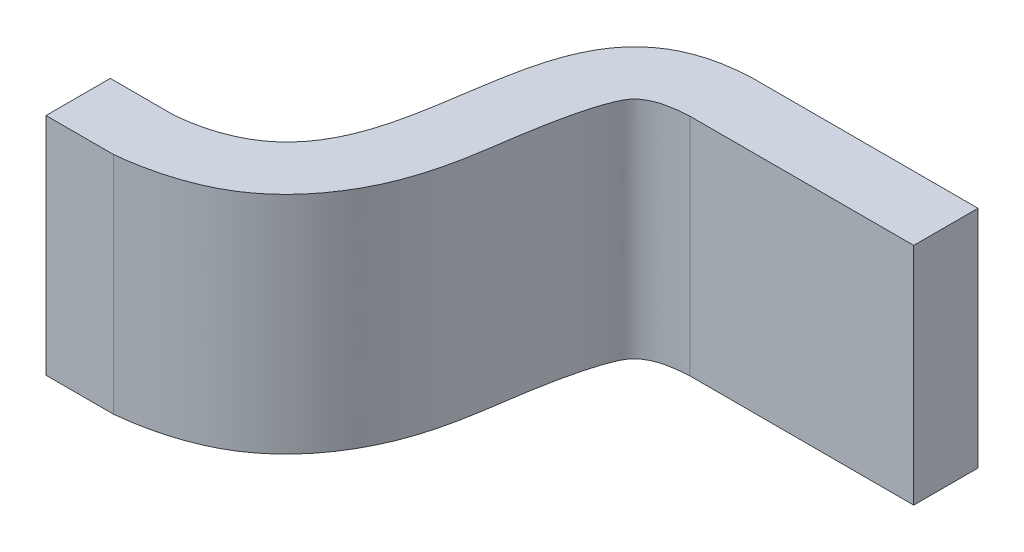
ISO-10303-21;
HEADER;
FILE_DESCRIPTION(('STEP AP214'),'2;1');
FILE_NAME('part.step','',(''),(''),'','','');
FILE_SCHEMA(('AUTOMOTIVE_DESIGN { 1 0 10303 214 1 1 1 1 }'));
ENDSEC;
DATA;
#1=APPLICATION_CONTEXT('core data for automotive mechanical design processes');
#2=APPLICATION_PROTOCOL_DEFINITION('international standard','automotive_design',2000,#1);
#3=PRODUCT_CONTEXT('',#1,'mechanical');
#4=PRODUCT('Part','Part','',(#3));
#5=PRODUCT_RELATED_PRODUCT_CATEGORY('part','',(#4));
#6=PRODUCT_DEFINITION_FORMATION('','',#4);
#7=PRODUCT_DEFINITION_CONTEXT('part definition',#1,'design');
#8=PRODUCT_DEFINITION('design','',#6,#7);
#9=PRODUCT_DEFINITION_SHAPE('','',#8);
#10=(LENGTH_UNIT() NAMED_UNIT(*) SI_UNIT(.MILLI.,.METRE.));
#11=(NAMED_UNIT(*) PLANE_ANGLE_UNIT() SI_UNIT($,.RADIAN.));
#12=(NAMED_UNIT(*) SI_UNIT($,.STERADIAN.) SOLID_ANGLE_UNIT());
#13=UNCERTAINTY_MEASURE_WITH_UNIT(LENGTH_MEASURE(1.E-05),#10,'distance_accuracy_value','');
#14=(GEOMETRIC_REPRESENTATION_CONTEXT(3) GLOBAL_UNCERTAINTY_ASSIGNED_CONTEXT((#13)) GLOBAL_UNIT_ASSIGNED_CONTEXT((#10,
#11,#12)) REPRESENTATION_CONTEXT('',''));
#15=CARTESIAN_POINT('',(0.,0.,0.));
#16=DIRECTION('',(0.,0.,1.));
#17=DIRECTION('',(1.,0.,0.));
#18=AXIS2_PLACEMENT_3D('',#15,#16,#17);
#19=CARTESIAN_POINT('',(0.381062000989914,-3.47687603414217,1.19999985356685));
#20=DIRECTION('',(0.,1.,4.37113882867379E-08));
#21=DIRECTION('',(-1.,0.,0.));
#22=AXIS2_PLACEMENT_3D('',#19,#20,#21);
#23=PLANE('',#22);
#24=DIRECTION('',(-1.,0.,0.));
#25=VECTOR('',#24,1.);
#26=CARTESIAN_POINT('',(8.91606200098991,-3.47687599043078,0.199999853566849));
#27=LINE('',#26,#25);
#28=CARTESIAN_POINT('',(8.91606200098991,-3.47687599043078,0.199999853566849));
#29=VERTEX_POINT('',#28);
#30=CARTESIAN_POINT('',(8.21956578272591,-3.47687599043078,0.199999853566849));
#31=VERTEX_POINT('',#30);
#32=EDGE_CURVE('E11',#29,#31,#27,.T.);
#33=ORIENTED_EDGE('',*,*,#32,.T.);
#34=CARTESIAN_POINT('',(7.42586117783791,-3.47687603414217,1.19999985356685));
#35=CARTESIAN_POINT('',(7.44449456455245,-3.47687603406166,1.19815800024526));
#36=CARTESIAN_POINT('',(7.46307138920936,-3.47687603395427,1.1957012238173));
#37=CARTESIAN_POINT('',(7.50004861252762,-3.47687603368307,1.18949682423011));
#38=CARTESIAN_POINT('',(7.51844854392413,-3.47687603351913,1.18574642673535));
#39=CARTESIAN_POINT('',(7.55509153595032,-3.47687603313076,1.1768614504023));
#40=CARTESIAN_POINT('',(7.57333169379044,-3.47687603290579,1.17171471620827));
#41=CARTESIAN_POINT('',(7.60930812319983,-3.47687603239066,1.15992992349783));
#42=CARTESIAN_POINT('',(7.62704477874541,-3.47687603210055,1.15329303778763));
#43=CARTESIAN_POINT('',(7.66763102639651,-3.47687603133701,1.13582532460973));
#44=CARTESIAN_POINT('',(7.69020930230345,-3.47687603083472,1.12433411949993));
#45=CARTESIAN_POINT('',(7.73310469641282,-3.47687602967858,1.09788489937365));
#46=CARTESIAN_POINT('',(7.75343190343484,-3.47687602902546,1.08294336266544));
#47=CARTESIAN_POINT('',(7.79009677821303,-3.47687602765227,1.05152836561377));
#48=CARTESIAN_POINT('',(7.80662324596257,-3.47687602694167,1.0352716695965));
#49=CARTESIAN_POINT('',(7.83755765996604,-3.47687602543449,1.00079135092781));
#50=CARTESIAN_POINT('',(7.85196002142665,-3.47687602463769,0.982562754126248));
#51=CARTESIAN_POINT('',(7.88022177077409,-3.47687602287818,0.942309972603255));
#52=CARTESIAN_POINT('',(7.89380605024984,-3.47687602190706,0.920093186124081));
#53=CARTESIAN_POINT('',(7.91819190207817,-3.47687601990227,0.87422897098033));
#54=CARTESIAN_POINT('',(7.92899719645396,-3.47687601886869,0.850583508813256));
#55=CARTESIAN_POINT('',(7.94870311897535,-3.4768760166685,0.800248980346848));
#56=CARTESIAN_POINT('',(7.95737164040109,-3.47687601549796,0.773470089068371));
#57=CARTESIAN_POINT('',(7.97209186166946,-3.4768760131256,0.719196833192922));
#58=CARTESIAN_POINT('',(7.97814037844916,-3.47687601192374,0.691701641089337));
#59=CARTESIAN_POINT('',(7.98658106878576,-3.47687600995746,0.64671843633835));
#60=CARTESIAN_POINT('',(7.9894956830336,-3.47687600919702,0.629321297123908));
#61=CARTESIAN_POINT('',(7.99494513059396,-3.4768760076734,0.594464888859918));
#62=CARTESIAN_POINT('',(7.99747987765394,-3.47687600691023,0.577005606618711));
#63=CARTESIAN_POINT('',(8.0025677923373,-3.47687600538413,0.542092659422762));
#64=CARTESIAN_POINT('',(8.00512095631431,-3.47687600462121,0.524638994034041));
#65=CARTESIAN_POINT('',(8.01066424363703,-3.47687600309859,0.489805448400219));
#66=CARTESIAN_POINT('',(8.01365424883576,-3.47687600233889,0.472425549508169));
#67=CARTESIAN_POINT('',(8.02152943419566,-3.47687600048514,0.430016740032559));
#68=CARTESIAN_POINT('',(8.02666524973689,-3.47687599939302,0.405032011816053));
#69=CARTESIAN_POINT('',(8.03548182293313,-3.47687599776612,0.367812734985579));
#70=CARTESIAN_POINT('',(8.03860689712085,-3.4768759972256,0.355446814341548));
#71=CARTESIAN_POINT('',(8.04536938827822,-3.47687599615076,0.330857923410729));
#72=CARTESIAN_POINT('',(8.0490065173587,-3.47687599561644,0.318634876950399));
#73=CARTESIAN_POINT('',(8.05548047715351,-3.47687599477455,0.299373221215939));
#74=CARTESIAN_POINT('',(8.05804302673184,-3.47687599446296,0.292243807444686));
#75=CARTESIAN_POINT('',(8.0636211387904,-3.47687599384772,0.27817171935325));
#76=CARTESIAN_POINT('',(8.06663601514539,-3.47687599354405,0.271228780663558));
#77=CARTESIAN_POINT('',(8.07290394389426,-3.47687599300993,0.258999768411459));
#78=CARTESIAN_POINT('',(8.07601005444361,-3.47687599277632,0.253644591727609));
#79=CARTESIAN_POINT('',(8.08294021652617,-3.47687599236733,0.24431585073112));
#80=CARTESIAN_POINT('',(8.08663640359496,-3.47687599218833,0.240253829951384));
#81=CARTESIAN_POINT('',(8.09608537337927,-3.47687599183599,0.232075819782313));
#82=CARTESIAN_POINT('',(8.10212282018808,-3.47687599168021,0.228303905554506));
#83=CARTESIAN_POINT('',(8.1113394806663,-3.47687599144317,0.223112945284577));
#84=CARTESIAN_POINT('',(8.11442600625127,-3.4768759913639,0.221466013892201));
#85=CARTESIAN_POINT('',(8.12071629067352,-3.47687599124101,0.218417225329413));
#86=CARTESIAN_POINT('',(8.12391972716149,-3.47687599119728,0.217014747998716));
#87=CARTESIAN_POINT('',(8.13303992233348,-3.47687599106817,0.21346489598315));
#88=CARTESIAN_POINT('',(8.13907333321131,-3.47687599097749,0.211621552848285));
#89=CARTESIAN_POINT('',(8.14884209661085,-3.47687599084498,0.209137060916208));
#90=CARTESIAN_POINT('',(8.15253527613093,-3.47687599079807,0.20830954664572));
#91=CARTESIAN_POINT('',(8.15995085696976,-3.47687599072394,0.206799511724326));
#92=CARTESIAN_POINT('',(8.16367325397941,-3.47687599069671,0.206116970094035));
#93=CARTESIAN_POINT('',(8.17603608060719,-3.47687599061041,0.204031929793534));
#94=CARTESIAN_POINT('',(8.18471588454658,-3.47687599055652,0.20286096389716));
#95=CARTESIAN_POINT('',(8.19776684921997,-3.47687599049499,0.201476448842084));
#96=CARTESIAN_POINT('',(8.20211947594062,-3.4768759904777,0.201077075020748));
#97=CARTESIAN_POINT('',(8.21083512156969,-3.47687599044948,0.200423844313514));
#98=CARTESIAN_POINT('',(8.2151981395132,-3.47687599043856,0.20016997440803));
#99=CARTESIAN_POINT('',(8.21956578272591,-3.47687599043078,0.199999853566849));
#100=B_SPLINE_CURVE_WITH_KNOTS('',3,(#34,#35,#36,#37,#38,#39,#40,#41,#42,#43,#44,#45,#46,#47,
#48,#49,#50,#51,#52,#53,#54,#55,#56,#57,#58,#59,#60,#61,#62,#63,#64,#65,#66,#67,#68,#69,#70,#71,
#72,#73,#74,#75,#76,#77,#78,#79,#80,#81,#82,#83,#84,#85,#86,#87,#88,#89,#90,#91,#92,#93,#94,#95,
#96,#97,#98,#99),.UNSPECIFIED.,.F.,.F.,(4,2,2,2,2,2,2,2,2,2,2,2,2,2,2,2,2,2,2,2,2,2,2,2,2,2,2,2,
2,2,2,2,4),(0.,0.0561681589095707,0.112457534383138,0.16925357861237,0.226005077906886,
0.301715004036543,0.377070566346,0.446424912055152,0.515958475234817,0.593880428548584,
0.671697467408244,0.75596451716301,0.84033365838221,0.893247792631841,0.946173923407373,
0.999089848164164,1.05199148781442,1.12847716172406,1.16673541076623,1.20497223539784,
1.22769072756634,1.25037510056687,1.26886797593494,1.28517999290265,1.30634908955326,
1.31685139211729,1.32732665061524,1.34619861049414,1.35755137220421,1.36890248990409,
1.39515927363249,1.40827024085607,1.42138003473644),.UNSPECIFIED.);
#101=CARTESIAN_POINT('',(7.42586117783791,-3.47687603414217,1.19999985356685));
#102=VERTEX_POINT('',#101);
#103=EDGE_CURVE('E187',#102,#31,#100,.T.);
#104=ORIENTED_EDGE('',*,*,#103,.F.);
#105=DIRECTION('',(1.,0.,0.));
#106=VECTOR('',#105,1.);
#107=CARTESIAN_POINT('',(7.21606200098991,-3.47687603414216,1.19999985356685));
#108=LINE('',#107,#106);
#109=CARTESIAN_POINT('',(7.21606200098991,-3.47687603414217,1.19999985356685));
#110=VERTEX_POINT('',#109);
#111=EDGE_CURVE('E163',#110,#102,#108,.T.);
#112=ORIENTED_EDGE('',*,*,#111,.F.);
#113=DIRECTION('',(0.,4.37113878426487E-08,-0.999999999999999));
#114=VECTOR('',#113,1.);
#115=CARTESIAN_POINT('',(7.21606200098991,-3.47687603414217,1.19999985356685));
#116=LINE('',#115,#114);
#117=CARTESIAN_POINT('',(7.21606200098991,-3.47687602539989,0.999999853566849));
#118=VERTEX_POINT('',#117);
#119=EDGE_CURVE('E155',#110,#118,#116,.T.);
#120=ORIENTED_EDGE('',*,*,#119,.T.);
#121=DIRECTION('',(1.,0.,0.));
#122=VECTOR('',#121,1.);
#123=CARTESIAN_POINT('',(7.21606200098991,-3.47687602539989,0.999999853566849));
#124=LINE('',#123,#122);
#125=CARTESIAN_POINT('',(7.41606200098991,-3.47687602539989,0.999999853566849));
#126=VERTEX_POINT('',#125);
#127=EDGE_CURVE('E148',#118,#126,#124,.T.);
#128=ORIENTED_EDGE('',*,*,#127,.T.);
#129=CARTESIAN_POINT('',(7.41606200098991,-3.47687602539989,0.999999853566849));
#130=CARTESIAN_POINT('',(7.43815778445574,-3.47687602530467,0.997821363378803));
#131=CARTESIAN_POINT('',(7.46027008731141,-3.47687602516058,0.994524992319805));
#132=CARTESIAN_POINT('',(7.50408400428581,-3.47687602474309,0.984973999806053));
#133=CARTESIAN_POINT('',(7.52577839318445,-3.47687602446828,0.978687133446075));
#134=CARTESIAN_POINT('',(7.56322329112044,-3.47687602383577,0.964217061903684));
#135=CARTESIAN_POINT('',(7.5792399824135,-3.47687602350913,0.956744157681285));
#136=CARTESIAN_POINT('',(7.60983504569206,-3.47687602275081,0.939395910983816));
#137=CARTESIAN_POINT('',(7.62441982579596,-3.47687602231964,0.929532028551954));
#138=CARTESIAN_POINT('',(7.65126115653245,-3.47687602137223,0.907857820702243));
#139=CARTESIAN_POINT('',(7.6635794953477,-3.47687602085934,0.896124080689931));
#140=CARTESIAN_POINT('',(7.68622733401037,-3.47687601975463,0.870851202194942));
#141=CARTESIAN_POINT('',(7.69655342153458,-3.47687601916268,0.857309032186523));
#142=CARTESIAN_POINT('',(7.7288475675845,-3.47687601701589,0.808196393991896));
#143=CARTESIAN_POINT('',(7.74576979626087,-3.47687601531836,0.769361408858456));
#144=CARTESIAN_POINT('',(7.76850315318357,-3.47687601228944,0.700067620687221));
#145=CARTESIAN_POINT('',(7.77605677562103,-3.47687601097706,0.670043871769161));
#146=CARTESIAN_POINT('',(7.78893462477029,-3.47687600832878,0.609458291277649));
#147=CARTESIAN_POINT('',(7.79425506876476,-3.47687600699284,0.578895637360986));
#148=CARTESIAN_POINT('',(7.80736012985758,-3.476876003414,0.497021351625423));
#149=CARTESIAN_POINT('',(7.81438963042532,-3.4768760011665,0.445604528778748));
#150=CARTESIAN_POINT('',(7.82796229628551,-3.47687599781692,0.368975045837079));
#151=CARTESIAN_POINT('',(7.83298877156952,-3.47687599670443,0.343524079365537));
#152=CARTESIAN_POINT('',(7.84502531219308,-3.4768759945012,0.293120201610462));
#153=CARTESIAN_POINT('',(7.85203211919115,-3.47687599341043,0.268166543683047));
#154=CARTESIAN_POINT('',(7.8696664235696,-3.47687599122936,0.218269493752244));
#155=CARTESIAN_POINT('',(7.88043363403057,-3.476875990141,0.19337055401301));
#156=CARTESIAN_POINT('',(7.90026910052031,-3.47687598860283,0.158181114031211));
#157=CARTESIAN_POINT('',(7.90746633375543,-3.47687598810726,0.146843820328245));
#158=CARTESIAN_POINT('',(7.92318388320907,-3.47687598715831,0.125134406221757));
#159=CARTESIAN_POINT('',(7.93170293407124,-3.47687598670489,0.114761377771715));
#160=CARTESIAN_POINT('',(7.95303839952588,-3.47687598571421,0.0920974605824844));
#161=CARTESIAN_POINT('',(7.96635443397192,-3.47687598519713,0.0802678988908172));
#162=CARTESIAN_POINT('',(7.99492929472639,-3.47687598427693,0.0592160823492658));
#163=CARTESIAN_POINT('',(8.01019136911424,-3.476875983874,0.0499982715306266));
#164=CARTESIAN_POINT('',(8.04268080697371,-3.47687598316908,0.0338716888207509));
#165=CARTESIAN_POINT('',(8.05996419457089,-3.47687598287213,0.0270780092305753));
#166=CARTESIAN_POINT('',(8.09533290547705,-3.47687598238776,0.015996926953095));
#167=CARTESIAN_POINT('',(8.11342000632037,-3.47687598220061,0.0117154108145124));
#168=CARTESIAN_POINT('',(8.14565822903883,-3.47687598194948,0.00597036540082591));
#169=CARTESIAN_POINT('',(8.15973896311656,-3.47687598186693,0.00408168117578829));
#170=CARTESIAN_POINT('',(8.18790024228703,-3.47687598174668,0.00133069078066249));
#171=CARTESIAN_POINT('',(8.20198005813918,-3.47687598170866,0.000461089362854821));
#172=CARTESIAN_POINT('',(8.21606200098995,-3.4768759816885,-1.46433151940948E-07));
#173=B_SPLINE_CURVE_WITH_KNOTS('',3,(#129,#130,#131,#132,#133,#134,#135,#136,#137,#138,#139,
#140,#141,#142,#143,#144,#145,#146,#147,#148,#149,#150,#151,#152,#153,#154,#155,#156,#157,#158,
#159,#160,#161,#162,#163,#164,#165,#166,#167,#168,#169,#170,#171,#172),.UNSPECIFIED.,.F.,.F.,(4,
2,2,2,2,2,2,2,2,2,2,2,2,2,2,2,2,2,2,2,2,4),(0.,0.066782113709088,0.134301214684031,
0.187128508823994,0.239707439757742,0.290518731452934,0.34141629467506,0.466712259088975,
0.559563019654511,0.652570428897924,0.808245450373598,0.886023921415198,0.96367515719079,
1.04458784966541,1.08478909463837,1.12495209032638,1.17807587168457,1.2312895104201,
1.28677003517691,1.34238004906255,1.38496468867346,1.42724258099923),.UNSPECIFIED.);
#174=CARTESIAN_POINT('',(8.21606200098991,-3.4768759816885,-1.46433150760572E-07));
#175=VERTEX_POINT('',#174);
#176=EDGE_CURVE('E100',#126,#175,#173,.T.);
#177=ORIENTED_EDGE('',*,*,#176,.T.);
#178=DIRECTION('',(1.,0.,0.));
#179=VECTOR('',#178,1.);
#180=CARTESIAN_POINT('',(8.21606200098991,-3.4768759816885,-1.46433150760572E-07));
#181=LINE('',#180,#179);
#182=CARTESIAN_POINT('',(8.91606200098991,-3.4768759816885,-1.46433150760572E-07));
#183=VERTEX_POINT('',#182);
#184=EDGE_CURVE('E94',#175,#183,#181,.T.);
#185=ORIENTED_EDGE('',*,*,#184,.T.);
#186=DIRECTION('',(0.,4.37113900630947E-08,-0.999999999999999));
#187=VECTOR('',#186,1.);
#188=CARTESIAN_POINT('',(8.91606200098991,-3.47687599043078,0.199999853566849));
#189=LINE('',#188,#187);
#190=EDGE_CURVE('E195',#29,#183,#189,.T.);
#191=ORIENTED_EDGE('',*,*,#190,.F.);
#192=EDGE_LOOP('',(#33,#104,#112,#120,#128,#177,#185,#191));
#193=FACE_BOUND('',#192,.T.);
#194=ADVANCED_FACE('F17',(#193),#23,.F.);
#195=CARTESIAN_POINT('',(8.91606200098991,-0.126876034142165,1.2));
#196=DIRECTION('',(-1.,0.,0.));
#197=DIRECTION('',(0.,-1.,-4.37113882867379E-08));
#198=AXIS2_PLACEMENT_3D('',#195,#196,#197);
#199=PLANE('',#198);
#200=DIRECTION('',(0.,-0.999999999999999,-4.37113886356658E-08));
#201=VECTOR('',#200,1.);
#202=CARTESIAN_POINT('',(8.91606200098992,-2.77687599043078,0.199999884164821));
#203=LINE('',#202,#201);
#204=CARTESIAN_POINT('',(8.91606200098991,-2.77687599043078,0.199999884164821));
#205=VERTEX_POINT('',#204);
#206=EDGE_CURVE('E25',#205,#29,#203,.T.);
#207=ORIENTED_EDGE('',*,*,#206,.T.);
#208=ORIENTED_EDGE('',*,*,#190,.T.);
#209=DIRECTION('',(0.,0.999999999999999,4.37113882867379E-08));
#210=VECTOR('',#209,1.);
#211=CARTESIAN_POINT('',(8.91606200098991,-3.4768759816885,-1.46433150760572E-07));
#212=LINE('',#211,#210);
#213=CARTESIAN_POINT('',(8.91606200098991,-2.7768759816885,-1.15835178959856E-07));
#214=VERTEX_POINT('',#213);
#215=EDGE_CURVE('E157',#183,#214,#212,.T.);
#216=ORIENTED_EDGE('',*,*,#215,.T.);
#217=DIRECTION('',(0.,4.37113878426487E-08,-0.999999999999999));
#218=VECTOR('',#217,1.);
#219=CARTESIAN_POINT('',(8.91606200098991,-2.77687599043078,0.199999884164821));
#220=LINE('',#219,#218);
#221=EDGE_CURVE('E150',#205,#214,#220,.T.);
#222=ORIENTED_EDGE('',*,*,#221,.F.);
#223=EDGE_LOOP('',(#207,#208,#216,#222));
#224=FACE_BOUND('',#223,.T.);
#225=ADVANCED_FACE('F207',(#224),#199,.F.);
#226=CARTESIAN_POINT('',(0.381062000989914,-2.77687603414217,1.19999988416482));
#227=DIRECTION('',(0.,1.,4.37113882867379E-08));
#228=DIRECTION('',(-1.,0.,0.));
#229=AXIS2_PLACEMENT_3D('',#226,#227,#228);
#230=PLANE('',#229);
#231=CARTESIAN_POINT('',(8.21956578272591,-2.77687599043078,0.199999884164821));
#232=CARTESIAN_POINT('',(8.21399807265752,-2.77687599044052,0.200222545274547));
#233=CARTESIAN_POINT('',(8.20843683975348,-2.77687599045581,0.20057241023223));
#234=CARTESIAN_POINT('',(8.19732835868844,-2.77687599049638,0.201500542733154));
#235=CARTESIAN_POINT('',(8.19178112714533,-2.77687599052166,0.202079011044646));
#236=CARTESIAN_POINT('',(8.18066889231238,-2.77687599058129,0.203443090764304));
#237=CARTESIAN_POINT('',(8.17510408096633,-2.7768759906157,0.20423026255715));
#238=CARTESIAN_POINT('',(8.16401243640824,-2.77687599069444,0.206031793785161));
#239=CARTESIAN_POINT('',(8.15848559635561,-2.77687599073877,0.207046111131485));
#240=CARTESIAN_POINT('',(8.1465743503038,-2.7768759908516,0.209627208268326));
#241=CARTESIAN_POINT('',(8.14020246940725,-2.77687599092292,0.211258301325649));
#242=CARTESIAN_POINT('',(8.12921644404484,-2.77687599108146,0.214886050566054));
#243=CARTESIAN_POINT('',(8.12454576276441,-2.77687599116083,0.216702528900893));
#244=CARTESIAN_POINT('',(8.11575076349414,-2.77687599133753,0.22074290890376));
#245=CARTESIAN_POINT('',(8.11161057174428,-2.7768759914334,0.222933797612517));
#246=CARTESIAN_POINT('',(8.10253183379761,-2.77687599165908,0.228105057200506));
#247=CARTESIAN_POINT('',(8.09762635625911,-2.77687599179163,0.231151563888761));
#248=CARTESIAN_POINT('',(8.09022405842899,-2.77687599204976,0.237031262748699));
#249=CARTESIAN_POINT('',(8.08749164440591,-2.77687599216102,0.239553954442836));
#250=CARTESIAN_POINT('',(8.08246087272025,-2.77687599239664,0.245002599685691));
#251=CARTESIAN_POINT('',(8.08016330387861,-2.77687599252104,0.247929269748009));
#252=CARTESIAN_POINT('',(8.0759951087917,-2.77687599278596,0.253960404586634));
#253=CARTESIAN_POINT('',(8.07411551519148,-2.77687599292603,0.257058872068492));
#254=CARTESIAN_POINT('',(8.0706064493533,-2.77687599320065,0.263392751592157));
#255=CARTESIAN_POINT('',(8.06897710136162,-2.7768759933352,0.266628230649383));
#256=CARTESIAN_POINT('',(8.06367328775614,-2.77687599380605,0.277849729754884));
#257=CARTESIAN_POINT('',(8.06040085858409,-2.77687599415608,0.286021915952385));
#258=CARTESIAN_POINT('',(8.05218527798452,-2.77687599513481,0.308422027366586));
#259=CARTESIAN_POINT('',(8.04771455008865,-2.77687599578428,0.322813120641394));
#260=CARTESIAN_POINT('',(8.03961753260657,-2.77687599705468,0.351469785882452));
#261=CARTESIAN_POINT('',(8.03597437543716,-2.77687599767592,0.365730789493319));
#262=CARTESIAN_POINT('',(8.02919339350917,-2.77687599892581,0.394362004356696));
#263=CARTESIAN_POINT('',(8.02605527280587,-2.77687599955446,0.40873214644714));
#264=CARTESIAN_POINT('',(8.01736410075411,-2.77687600140894,0.451139407892786));
#265=CARTESIAN_POINT('',(8.01232518312452,-2.77687600263876,0.479282620997365));
#266=CARTESIAN_POINT('',(8.00335647907099,-2.77687600510942,0.535811059461233));
#267=CARTESIAN_POINT('',(7.99942969347175,-2.77687600635029,0.564196730647227));
#268=CARTESIAN_POINT('',(7.99170167000416,-2.77687600860292,0.615729651786947));
#269=CARTESIAN_POINT('',(7.98800715437185,-2.77687600961537,0.638891994813737));
#270=CARTESIAN_POINT('',(7.9794355355205,-2.77687601163106,0.685005694258183));
#271=CARTESIAN_POINT('',(7.97455858675596,-2.7768760126343,0.707957077826197));
#272=CARTESIAN_POINT('',(7.96311271686074,-2.77687601461768,0.75333148285881));
#273=CARTESIAN_POINT('',(7.95655194608926,-2.77687601559791,0.775756496819381));
#274=CARTESIAN_POINT('',(7.94136784202336,-2.77687601752719,0.819893535968628));
#275=CARTESIAN_POINT('',(7.93274558328642,-2.77687601847627,0.841605925931372));
#276=CARTESIAN_POINT('',(7.91043792110496,-2.77687602059855,0.890158260432963));
#277=CARTESIAN_POINT('',(7.89600936729224,-2.7768760217571,0.916662526770142));
#278=CARTESIAN_POINT('',(7.86347434987593,-2.77687602397549,0.9674132870107));
#279=CARTESIAN_POINT('',(7.84535977466741,-2.7768760250351,0.991654626364154));
#280=CARTESIAN_POINT('',(7.80790002602412,-2.77687602689358,1.03417149020099));
#281=CARTESIAN_POINT('',(7.78897432705134,-2.77687602770848,1.05281403345911));
#282=CARTESIAN_POINT('',(7.7484456583354,-2.77687602919522,1.08682684057683));
#283=CARTESIAN_POINT('',(7.72685155874366,-2.77687602986752,1.10220750767774));
#284=CARTESIAN_POINT('',(7.68359472899703,-2.77687603098652,1.1278071446038));
#285=CARTESIAN_POINT('',(7.66213857495582,-2.7768760314487,1.13838039934658));
#286=CARTESIAN_POINT('',(7.61806563506123,-2.7768760322593,1.15692477793749));
#287=CARTESIAN_POINT('',(7.59544469766517,-2.77687603260728,1.16488572377528));
#288=CARTESIAN_POINT('',(7.54848495398506,-2.77687603321614,1.17881496183062));
#289=CARTESIAN_POINT('',(7.52411482818413,-2.77687603347234,1.18467600751106));
#290=CARTESIAN_POINT('',(7.47514110847119,-2.77687603388116,1.19402853971283));
#291=CARTESIAN_POINT('',(7.4505414125435,-2.77687603403467,1.19754027436313));
#292=CARTESIAN_POINT('',(7.42586117783791,-2.77687603414217,1.19999988416482));
#293=B_SPLINE_CURVE_WITH_KNOTS('',3,(#231,#232,#233,#234,#235,#236,#237,#238,#239,#240,#241,
#242,#243,#244,#245,#246,#247,#248,#249,#250,#251,#252,#253,#254,#255,#256,#257,#258,#259,#260,
#261,#262,#263,#264,#265,#266,#267,#268,#269,#270,#271,#272,#273,#274,#275,#276,#277,#278,#279,
#280,#281,#282,#283,#284,#285,#286,#287,#288,#289,#290,#291,#292),.UNSPECIFIED.,.F.,.F.,(4,2,2,
2,2,2,2,2,2,2,2,2,2,2,2,2,2,2,2,2,2,2,2,2,2,2,2,2,2,2,4),(0.,0.0167129049826591,
0.0334405206169284,0.0502969119078463,0.0671501823813333,0.0868449977925691,0.101838970321101,
0.115885127156847,0.133132127804882,0.144236213112223,0.155360252414284,0.166215762863006,
0.177076645740436,0.203446553112074,0.248618617741083,0.292765096579105,0.336885611219406,
0.422622380023027,0.508588331833519,0.578941414817055,0.649285312924701,0.719294937731848,
0.789268149044609,0.879502218060822,0.96993705004022,1.04934324822105,1.12849225200603,
1.20002463783799,1.271832505571,1.34691026454656,1.42133231106535),.UNSPECIFIED.);
#294=CARTESIAN_POINT('',(8.21956578272591,-2.77687599043078,0.199999884164821));
#295=VERTEX_POINT('',#294);
#296=CARTESIAN_POINT('',(7.42586117783791,-2.77687603414217,1.19999988416482));
#297=VERTEX_POINT('',#296);
#298=EDGE_CURVE('E181',#295,#297,#293,.T.);
#299=ORIENTED_EDGE('',*,*,#298,.F.);
#300=DIRECTION('',(1.,0.,0.));
#301=VECTOR('',#300,1.);
#302=CARTESIAN_POINT('',(8.21956578272592,-2.77687599043078,0.199999884164821));
#303=LINE('',#302,#301);
#304=EDGE_CURVE('E159',#295,#205,#303,.T.);
#305=ORIENTED_EDGE('',*,*,#304,.T.);
#306=ORIENTED_EDGE('',*,*,#221,.T.);
#307=DIRECTION('',(1.,0.,0.));
#308=VECTOR('',#307,1.);
#309=CARTESIAN_POINT('',(8.21606200098991,-2.7768759816885,-1.15835178959856E-07));
#310=LINE('',#309,#308);
#311=CARTESIAN_POINT('',(8.21606200098991,-2.7768759816885,-1.15835178959856E-07));
#312=VERTEX_POINT('',#311);
#313=EDGE_CURVE('E90',#312,#214,#310,.T.);
#314=ORIENTED_EDGE('',*,*,#313,.F.);
#315=CARTESIAN_POINT('',(8.21606200098991,-2.7768759816885,-1.15835178989218E-07));
#316=CARTESIAN_POINT('',(8.19358510313693,-2.77687598172138,0.000751828798223215));
#317=CARTESIAN_POINT('',(8.17100793476501,-2.77687598179905,0.00252878210818271));
#318=CARTESIAN_POINT('',(8.12597309478915,-2.77687598208131,0.00898616856351866));
#319=CARTESIAN_POINT('',(8.10352138339691,-2.77687598228762,0.0137063757408246));
#320=CARTESIAN_POINT('',(8.06515365819845,-2.77687598279382,0.0252867766409508));
#321=CARTESIAN_POINT('',(8.04899929251523,-2.77687598305774,0.0313243554019478));
#322=CARTESIAN_POINT('',(8.01789140683102,-2.77687598369121,0.0458163888177864));
#323=CARTESIAN_POINT('',(8.00293202850773,-2.7768759840602,0.054257990538641));
#324=CARTESIAN_POINT('',(7.97580927414815,-2.77687598487283,0.0728487695511768));
#325=CARTESIAN_POINT('',(7.96351851659414,-2.77687598530831,0.0828113454701612));
#326=CARTESIAN_POINT('',(7.94069381725784,-2.77687598626057,0.10459648971887));
#327=CARTESIAN_POINT('',(7.93016206041085,-2.77687598677745,0.116421336371775));
#328=CARTESIAN_POINT('',(7.90934268339576,-2.77687598796568,0.143604933637193));
#329=CARTESIAN_POINT('',(7.89939730340265,-2.77687598864838,0.159223162210517));
#330=CARTESIAN_POINT('',(7.8817786902267,-2.77687599006819,0.191704792958366));
#331=CARTESIAN_POINT('',(7.87411125124448,-2.77687599080544,0.208571236417005));
#332=CARTESIAN_POINT('',(7.85831224281672,-2.77687599256403,0.248803200856693));
#333=CARTESIAN_POINT('',(7.85089650929935,-2.77687599359732,0.272441889034484));
#334=CARTESIAN_POINT('',(7.83819654268846,-2.77687599568625,0.320230895727307));
#335=CARTESIAN_POINT('',(7.83291120075709,-2.77687599674188,0.344380941180813));
#336=CARTESIAN_POINT('',(7.82019523572656,-2.7768759996159,0.410130810181529));
#337=CARTESIAN_POINT('',(7.81390954748546,-2.77687600144318,0.451934170412704));
#338=CARTESIAN_POINT('',(7.80123041061269,-2.77687600510757,0.535765697035456));
#339=CARTESIAN_POINT('',(7.79483655698354,-2.77687600694467,0.577793820022283));
#340=CARTESIAN_POINT('',(7.78272745030488,-2.77687600963624,0.639369616928019));
#341=CARTESIAN_POINT('',(7.77840818033405,-2.77687601050181,0.659171551216422));
#342=CARTESIAN_POINT('',(7.76846333575577,-2.77687601221968,0.698471606542054));
#343=CARTESIAN_POINT('',(7.76283677771603,-2.77687601307195,0.717969487006551));
#344=CARTESIAN_POINT('',(7.74980357127117,-2.7768760147411,0.756155132995515));
#345=CARTESIAN_POINT('',(7.7424162483515,-2.77687601555825,0.77484925808335));
#346=CARTESIAN_POINT('',(7.72528765923403,-2.77687601714307,0.811105816529293));
#347=CARTESIAN_POINT('',(7.71555219177743,-2.77687601791086,0.828670904766429));
#348=CARTESIAN_POINT('',(7.6929171221229,-2.7768760193913,0.862539384455967));
#349=CARTESIAN_POINT('',(7.67992280719315,-2.77687602010126,0.878781145734709));
#350=CARTESIAN_POINT('',(7.6509915949129,-2.77687602139555,0.908391244468524));
#351=CARTESIAN_POINT('',(7.63505740825526,-2.77687602198001,0.921762204555029));
#352=CARTESIAN_POINT('',(7.60251216289671,-2.77687602295392,0.944042697605554));
#353=CARTESIAN_POINT('',(7.58610329850445,-2.77687602335649,0.953252270237816));
#354=CARTESIAN_POINT('',(7.55200247896581,-2.77687602404617,0.969030296795614));
#355=CARTESIAN_POINT('',(7.53430550805647,-2.7768760243328,0.975587694142393));
#356=CARTESIAN_POINT('',(7.49987529020758,-2.77687602478264,0.985878983079623));
#357=CARTESIAN_POINT('',(7.48319962545166,-2.77687602495468,0.98981459032834));
#358=CARTESIAN_POINT('',(7.44971156339336,-2.77687602522663,0.996036085015086));
#359=CARTESIAN_POINT('',(7.43290223265527,-2.77687602532726,0.998338181632926));
#360=CARTESIAN_POINT('',(7.41606200098991,-2.77687602539989,0.999999884164821));
#361=B_SPLINE_CURVE_WITH_KNOTS('',3,(#315,#316,#317,#318,#319,#320,#321,#322,#323,#324,#325,
#326,#327,#328,#329,#330,#331,#332,#333,#334,#335,#336,#337,#338,#339,#340,#341,#342,#343,#344,
#345,#346,#347,#348,#349,#350,#351,#352,#353,#354,#355,#356,#357,#358,#359,#360),.UNSPECIFIED.,
.F.,.F.,(4,2,2,2,2,2,2,2,2,2,2,2,2,2,2,2,2,2,2,2,2,2,4),(0.,0.0676605368254322,
0.136255841823736,0.187815232472042,0.239103979458816,0.28635747593516,0.333669238509404,
0.38897897184657,0.44442821035716,0.518581097757563,0.592695339665636,0.719482422739693,
0.84697498806058,0.907746805484856,0.968564488536605,1.02874313069962,1.08877465652057,
1.15080863583323,1.21278570033354,1.2689745883637,1.32539536427915,1.3767136749948,
1.42751535438906),.UNSPECIFIED.);
#362=CARTESIAN_POINT('',(7.41606200098991,-2.77687602539989,0.999999884164821));
#363=VERTEX_POINT('',#362);
#364=EDGE_CURVE('E81',#312,#363,#361,.T.);
#365=ORIENTED_EDGE('',*,*,#364,.T.);
#366=DIRECTION('',(-1.,0.,0.));
#367=VECTOR('',#366,1.);
#368=CARTESIAN_POINT('',(7.41606200098991,-2.77687602539989,0.99999988416482));
#369=LINE('',#368,#367);
#370=CARTESIAN_POINT('',(7.21606200098991,-2.77687602539989,0.999999884164821));
#371=VERTEX_POINT('',#370);
#372=EDGE_CURVE('E86',#363,#371,#369,.T.);
#373=ORIENTED_EDGE('',*,*,#372,.T.);
#374=DIRECTION('',(0.,4.37113878426487E-08,-0.999999999999999));
#375=VECTOR('',#374,1.);
#376=CARTESIAN_POINT('',(7.21606200098991,-2.77687603414217,1.19999988416482));
#377=LINE('',#376,#375);
#378=CARTESIAN_POINT('',(7.21606200098991,-2.77687603414217,1.19999988416482));
#379=VERTEX_POINT('',#378);
#380=EDGE_CURVE('E161',#379,#371,#377,.T.);
#381=ORIENTED_EDGE('',*,*,#380,.F.);
#382=DIRECTION('',(1.,0.,0.));
#383=VECTOR('',#382,1.);
#384=CARTESIAN_POINT('',(7.21606200098991,-2.77687603414217,1.19999988416482));
#385=LINE('',#384,#383);
#386=EDGE_CURVE('E205',#379,#297,#385,.T.);
#387=ORIENTED_EDGE('',*,*,#386,.T.);
#388=EDGE_LOOP('',(#299,#305,#306,#314,#365,#373,#381,#387));
#389=FACE_BOUND('',#388,.T.);
#390=ADVANCED_FACE('F83',(#389),#230,.T.);
#391=CARTESIAN_POINT('',(7.21606200098991,-0.126876034142165,1.2));
#392=DIRECTION('',(-1.,0.,0.));
#393=DIRECTION('',(0.,-1.,-4.37113882867379E-08));
#394=AXIS2_PLACEMENT_3D('',#391,#392,#393);
#395=PLANE('',#394);
#396=ORIENTED_EDGE('',*,*,#380,.T.);
#397=DIRECTION('',(0.,-0.999999999999999,-4.3711388159856E-08));
#398=VECTOR('',#397,1.);
#399=CARTESIAN_POINT('',(7.21606200098992,-2.77687602539989,0.999999884164821));
#400=LINE('',#399,#398);
#401=EDGE_CURVE('E106',#371,#118,#400,.T.);
#402=ORIENTED_EDGE('',*,*,#401,.T.);
#403=ORIENTED_EDGE('',*,*,#119,.F.);
#404=DIRECTION('',(0.,0.999999999999999,4.37113881598552E-08));
#405=VECTOR('',#404,1.);
#406=CARTESIAN_POINT('',(7.21606200098991,-3.47687603414217,1.19999985356685));
#407=LINE('',#406,#405);
#408=EDGE_CURVE('E93',#110,#379,#407,.T.);
#409=ORIENTED_EDGE('',*,*,#408,.T.);
#410=EDGE_LOOP('',(#396,#402,#403,#409));
#411=FACE_BOUND('',#410,.T.);
#412=ADVANCED_FACE('F178',(#411),#395,.T.);
#413=CARTESIAN_POINT('',(0.381062000989914,-0.126875981688499,0.));
#414=DIRECTION('',(0.,-4.37113882867379E-08,1.));
#415=DIRECTION('',(0.,-1.,-4.37113882867379E-08));
#416=AXIS2_PLACEMENT_3D('',#413,#414,#415);
#417=PLANE('',#416);
#418=DIRECTION('',(0.,-0.999999999999999,-4.37113882867379E-08));
#419=VECTOR('',#418,1.);
#420=CARTESIAN_POINT('',(8.21606200098991,-2.7768759816885,-1.15835178959856E-07));
#421=LINE('',#420,#419);
#422=EDGE_CURVE('E153',#312,#175,#421,.T.);
#423=ORIENTED_EDGE('',*,*,#422,.F.);
#424=ORIENTED_EDGE('',*,*,#313,.T.);
#425=ORIENTED_EDGE('',*,*,#215,.F.);
#426=ORIENTED_EDGE('',*,*,#184,.F.);
#427=EDGE_LOOP('',(#423,#424,#425,#426));
#428=FACE_BOUND('',#427,.T.);
#429=ADVANCED_FACE('F129',(#428),#417,.F.);
#430=CARTESIAN_POINT('',(0.381062000989914,-0.126876034142165,1.2));
#431=DIRECTION('',(0.,-4.37113882867379E-08,1.));
#432=DIRECTION('',(0.,-1.,-4.37113882867379E-08));
#433=AXIS2_PLACEMENT_3D('',#430,#431,#432);
#434=PLANE('',#433);
#435=DIRECTION('',(0.,-0.999999999999999,-4.37113881598552E-08));
#436=VECTOR('',#435,1.);
#437=CARTESIAN_POINT('',(7.42586117783791,-2.77687603414217,1.19999988416482));
#438=LINE('',#437,#436);
#439=EDGE_CURVE('E145',#297,#102,#438,.T.);
#440=ORIENTED_EDGE('',*,*,#439,.F.);
#441=ORIENTED_EDGE('',*,*,#386,.F.);
#442=ORIENTED_EDGE('',*,*,#408,.F.);
#443=ORIENTED_EDGE('',*,*,#111,.T.);
#444=EDGE_LOOP('',(#440,#441,#442,#443));
#445=FACE_BOUND('',#444,.T.);
#446=ADVANCED_FACE('F128',(#445),#434,.T.);
#447=CARTESIAN_POINT('',(7.41606200098991,5.01775443609411,1.00000022487894));
#448=CARTESIAN_POINT('',(8.06137939913391,5.01775443886489,0.93661226287194));
#449=CARTESIAN_POINT('',(7.55196529161691,5.01775447886606,0.0214920441178097));
#450=CARTESIAN_POINT('',(8.21606200098991,5.0177544798055,2.24878939694144E-07));
#451=B_SPLINE_CURVE_WITH_KNOTS('',3,(#447,#448,#449,#450),.UNSPECIFIED.,.F.,.F.,(4,4),(0.,1.),.UNSPECIFIED.);
#452=DIRECTION('',(0.,-0.999999999999999,-4.37113882867379E-08));
#453=VECTOR('',#452,1.);
#454=SURFACE_OF_LINEAR_EXTRUSION('',#451,#453);
#455=ORIENTED_EDGE('',*,*,#422,.T.);
#456=ORIENTED_EDGE('',*,*,#176,.F.);
#457=DIRECTION('',(0.,-0.999999999999999,-4.3711388159856E-08));
#458=VECTOR('',#457,1.);
#459=CARTESIAN_POINT('',(7.41606200098991,-2.77687602539989,0.999999884164821));
#460=LINE('',#459,#458);
#461=EDGE_CURVE('E98',#363,#126,#460,.T.);
#462=ORIENTED_EDGE('',*,*,#461,.F.);
#463=ORIENTED_EDGE('',*,*,#364,.F.);
#464=EDGE_LOOP('',(#455,#456,#462,#463));
#465=FACE_BOUND('',#464,.T.);
#466=ADVANCED_FACE('F99',(#465),#454,.T.);
#467=CARTESIAN_POINT('',(0.381062000989914,5.01775443609411,1.00000022487894));
#468=DIRECTION('',(0.,4.37113882867379E-08,-1.));
#469=DIRECTION('',(0.,1.,4.37113882867379E-08));
#470=AXIS2_PLACEMENT_3D('',#467,#468,#469);
#471=PLANE('',#470);
#472=ORIENTED_EDGE('',*,*,#461,.T.);
#473=ORIENTED_EDGE('',*,*,#127,.F.);
#474=ORIENTED_EDGE('',*,*,#401,.F.);
#475=ORIENTED_EDGE('',*,*,#372,.F.);
#476=EDGE_LOOP('',(#472,#473,#474,#475));
#477=FACE_BOUND('',#476,.T.);
#478=ADVANCED_FACE('F104',(#477),#471,.T.);
#479=CARTESIAN_POINT('',(7.42586117783791,5.01775442735183,1.20000022487894));
#480=CARTESIAN_POINT('',(7.52323557934491,5.01775442776993,1.19043537372094));
#481=CARTESIAN_POINT('',(7.72758399467491,5.01775443018266,1.13523848292794));
#482=CARTESIAN_POINT('',(7.96817675723591,5.01775444236442,0.85655227210794));
#483=CARTESIAN_POINT('',(8.00047382700591,5.01775445822105,0.49379478761794));
#484=CARTESIAN_POINT('',(8.06032189164391,5.01775446848464,0.25899132482694));
#485=CARTESIAN_POINT('',(8.09817849874591,5.0177544697967,0.22897490490494));
#486=CARTESIAN_POINT('',(8.14111952633391,5.01775447070118,0.20828275194794));
#487=CARTESIAN_POINT('',(8.19602789838591,5.01775447102387,0.20090043049794));
#488=CARTESIAN_POINT('',(8.21956578272591,5.01775447106322,0.20000022487894));
#489=B_SPLINE_CURVE_WITH_KNOTS('',3,(#479,#480,#481,#482,#483,#484,#485,#486,#487,#488),
.UNSPECIFIED.,.F.,.F.,(4,1,1,1,1,1,1,4),(-0.005037439357121,0.120331553469,0.245700546295,
0.496438531947,0.747176517599,0.872545510425,0.935230006838,0.997914503251),.UNSPECIFIED.);
#490=DIRECTION('',(0.,-0.999999999999999,-4.37113882867379E-08));
#491=VECTOR('',#490,1.);
#492=SURFACE_OF_LINEAR_EXTRUSION('',#489,#491);
#493=ORIENTED_EDGE('',*,*,#298,.T.);
#494=ORIENTED_EDGE('',*,*,#439,.T.);
#495=ORIENTED_EDGE('',*,*,#103,.T.);
#496=DIRECTION('',(0.,-0.999999999999999,-4.37113886356658E-08));
#497=VECTOR('',#496,1.);
#498=CARTESIAN_POINT('',(8.21956578272592,-2.77687599043078,0.199999884164821));
#499=LINE('',#498,#497);
#500=EDGE_CURVE('E107',#295,#31,#499,.T.);
#501=ORIENTED_EDGE('',*,*,#500,.F.);
#502=EDGE_LOOP('',(#493,#494,#495,#501));
#503=FACE_BOUND('',#502,.T.);
#504=ADVANCED_FACE('F172',(#503),#492,.F.);
#505=CARTESIAN_POINT('',(0.381062000989914,5.01775447106322,0.20000022487894));
#506=DIRECTION('',(0.,-4.37113882867379E-08,1.));
#507=DIRECTION('',(-1.,0.,0.));
#508=AXIS2_PLACEMENT_3D('',#505,#506,#507);
#509=PLANE('',#508);
#510=ORIENTED_EDGE('',*,*,#500,.T.);
#511=ORIENTED_EDGE('',*,*,#32,.F.);
#512=ORIENTED_EDGE('',*,*,#206,.F.);
#513=ORIENTED_EDGE('',*,*,#304,.F.);
#514=EDGE_LOOP('',(#510,#511,#512,#513));
#515=FACE_BOUND('',#514,.T.);
#516=ADVANCED_FACE('F176',(#515),#509,.T.);
#517=CLOSED_SHELL('',(#194,#225,#390,#412,#429,#446,#466,#478,#504,#516));
#518=MANIFOLD_SOLID_BREP('B1',#517);
#519=ADVANCED_BREP_SHAPE_REPRESENTATION('',(#18,#518),#14);
#520=SHAPE_DEFINITION_REPRESENTATION(#9,#519);
ENDSEC;
END-ISO-10303-21;
